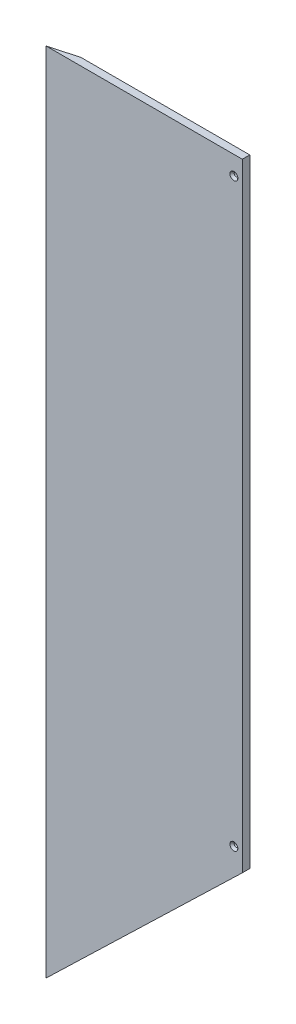
ISO-10303-21;
HEADER;
FILE_DESCRIPTION(('STEP AP214'),'2;1');
FILE_NAME('part.step','',(''),(''),'','','');
FILE_SCHEMA(('AUTOMOTIVE_DESIGN { 1 0 10303 214 1 1 1 1 }'));
ENDSEC;
DATA;
#1=APPLICATION_CONTEXT('core data for automotive mechanical design processes');
#2=APPLICATION_PROTOCOL_DEFINITION('international standard','automotive_design',2000,#1);
#3=PRODUCT_CONTEXT('',#1,'mechanical');
#4=PRODUCT('Part','Part','',(#3));
#5=PRODUCT_RELATED_PRODUCT_CATEGORY('part','',(#4));
#6=PRODUCT_DEFINITION_FORMATION('','',#4);
#7=PRODUCT_DEFINITION_CONTEXT('part definition',#1,'design');
#8=PRODUCT_DEFINITION('design','',#6,#7);
#9=PRODUCT_DEFINITION_SHAPE('','',#8);
#10=(LENGTH_UNIT() NAMED_UNIT(*) SI_UNIT(.MILLI.,.METRE.));
#11=(NAMED_UNIT(*) PLANE_ANGLE_UNIT() SI_UNIT($,.RADIAN.));
#12=(NAMED_UNIT(*) SI_UNIT($,.STERADIAN.) SOLID_ANGLE_UNIT());
#13=UNCERTAINTY_MEASURE_WITH_UNIT(LENGTH_MEASURE(1.E-05),#10,'distance_accuracy_value','');
#14=(GEOMETRIC_REPRESENTATION_CONTEXT(3) GLOBAL_UNCERTAINTY_ASSIGNED_CONTEXT((#13)) GLOBAL_UNIT_ASSIGNED_CONTEXT((#10,
#11,#12)) REPRESENTATION_CONTEXT('',''));
#15=CARTESIAN_POINT('',(0.,0.,0.));
#16=DIRECTION('',(0.,0.,1.));
#17=DIRECTION('',(1.,0.,0.));
#18=AXIS2_PLACEMENT_3D('',#15,#16,#17);
#19=CARTESIAN_POINT('',(-1480.98408110292,1371.6,12.7020000000002));
#20=DIRECTION('',(0.,-1.,0.));
#21=DIRECTION('',(-0.26471698178117,0.,-0.964326147917118));
#22=AXIS2_PLACEMENT_3D('',#19,#20,#21);
#23=PLANE('',#22);
#24=DIRECTION('',(0.964326147917118,0.,-0.26471698178117));
#25=VECTOR('',#24,1.);
#26=CARTESIAN_POINT('',(-61.2393104383737,1371.6,-422.666784086401));
#27=LINE('',#26,#25);
#28=CARTESIAN_POINT('',(-1647.21830961026,1371.6,12.7000000000002));
#29=VERTEX_POINT('',#28);
#30=CARTESIAN_POINT('',(-1600.95402389598,1371.6,2.22044604925031E-13));
#31=VERTEX_POINT('',#30);
#32=EDGE_CURVE('E104',#29,#31,#27,.T.);
#33=ORIENTED_EDGE('',*,*,#32,.F.);
#34=DIRECTION('',(-1.,0.,0.));
#35=VECTOR('',#34,1.);
#36=CARTESIAN_POINT('',(-1480.98408110292,1371.6,12.7000000000001));
#37=LINE('',#36,#35);
#38=CARTESIAN_POINT('',(-1314.74985259558,1371.6,12.7000000000002));
#39=VERTEX_POINT('',#38);
#40=EDGE_CURVE('E109',#39,#29,#37,.T.);
#41=ORIENTED_EDGE('',*,*,#40,.F.);
#42=DIRECTION('',(0.,0.,-1.));
#43=VECTOR('',#42,1.);
#44=CARTESIAN_POINT('',(-1314.74985259558,1371.6,12.7019999999997));
#45=LINE('',#44,#43);
#46=CARTESIAN_POINT('',(-1314.74985259558,1371.6,0.));
#47=VERTEX_POINT('',#46);
#48=EDGE_CURVE('E79',#39,#47,#45,.T.);
#49=ORIENTED_EDGE('',*,*,#48,.T.);
#50=DIRECTION('',(-1.,0.,0.));
#51=VECTOR('',#50,1.);
#52=CARTESIAN_POINT('',(-1480.98408110292,1371.6,-1.11022302462516E-13));
#53=LINE('',#52,#51);
#54=EDGE_CURVE('E111',#47,#31,#53,.T.);
#55=ORIENTED_EDGE('',*,*,#54,.T.);
#56=EDGE_LOOP('',(#33,#41,#49,#55));
#57=FACE_BOUND('',#56,.T.);
#58=ADVANCED_FACE('F48',(#57),#23,.F.);
#59=CARTESIAN_POINT('',(-1480.98408110292,687.420986771541,0.));
#60=DIRECTION('',(0.,0.,1.));
#61=DIRECTION('',(1.,0.,0.));
#62=AXIS2_PLACEMENT_3D('',#59,#60,#61);
#63=PLANE('',#62);
#64=CARTESIAN_POINT('',(-1329.03735259558,355.6,-3.33066907387547E-13));
#65=DIRECTION('',(0.,0.,1.));
#66=DIRECTION('',(1.,0.,0.));
#67=AXIS2_PLACEMENT_3D('',#64,#65,#66);
#68=CIRCLE('',#67,3.3782);
#69=CARTESIAN_POINT('',(-1325.65915259558,355.6,-3.33254435158636E-13));
#70=VERTEX_POINT('',#69);
#71=EDGE_CURVE('E52',#70,#70,#68,.F.);
#72=ORIENTED_EDGE('',*,*,#71,.F.);
#73=EDGE_LOOP('',(#72));
#74=FACE_BOUND('',#73,.T.);
#75=CARTESIAN_POINT('',(-1329.03735259558,1339.85,-3.88578058618805E-13));
#76=DIRECTION('',(0.,0.,1.));
#77=DIRECTION('',(1.,0.,0.));
#78=AXIS2_PLACEMENT_3D('',#75,#76,#77);
#79=CIRCLE('',#78,3.3782);
#80=CARTESIAN_POINT('',(-1325.65915259558,1339.85,-3.88765586389894E-13));
#81=VERTEX_POINT('',#80);
#82=EDGE_CURVE('E113',#81,#81,#79,.F.);
#83=ORIENTED_EDGE('',*,*,#82,.F.);
#84=EDGE_LOOP('',(#83));
#85=FACE_BOUND('',#84,.T.);
#86=DIRECTION('',(0.,-1.,0.));
#87=VECTOR('',#86,1.);
#88=CARTESIAN_POINT('',(-1600.95402389598,687.420986771541,2.22044604925031E-13));
#89=LINE('',#88,#87);
#90=CARTESIAN_POINT('',(-1600.95402389598,47.8558339720756,2.77555756156289E-13));
#91=VERTEX_POINT('',#90);
#92=EDGE_CURVE('E69',#31,#91,#89,.T.);
#93=ORIENTED_EDGE('',*,*,#92,.F.);
#94=ORIENTED_EDGE('',*,*,#54,.F.);
#95=DIRECTION('',(0.,-1.,0.));
#96=VECTOR('',#95,1.);
#97=CARTESIAN_POINT('',(-1314.74985259558,847.725,0.));
#98=LINE('',#97,#96);
#99=CARTESIAN_POINT('',(-1314.74985259558,323.85,0.));
#100=VERTEX_POINT('',#99);
#101=EDGE_CURVE('E58',#47,#100,#98,.T.);
#102=ORIENTED_EDGE('',*,*,#101,.T.);
#103=DIRECTION('',(-0.719829752215674,-0.694150652110275,0.));
#104=VECTOR('',#103,1.);
#105=CARTESIAN_POINT('',(-1480.98408110292,163.545986771541,1.66533453693773E-13));
#106=LINE('',#105,#104);
#107=EDGE_CURVE('E132',#100,#91,#106,.T.);
#108=ORIENTED_EDGE('',*,*,#107,.T.);
#109=EDGE_LOOP('',(#93,#94,#102,#108));
#110=FACE_BOUND('',#109,.T.);
#111=ADVANCED_FACE('F169',(#74,#85,#110),#63,.F.);
#112=CARTESIAN_POINT('',(-1480.98408110292,163.545986771541,12.702));
#113=DIRECTION('',(0.694150652110275,-0.719829752215675,0.));
#114=DIRECTION('',(0.706175147076652,0.680983159335232,-0.193852001158297));
#115=AXIS2_PLACEMENT_3D('',#112,#113,#114);
#116=PLANE('',#115);
#117=DIRECTION('',(-0.719829752215674,-0.694150652110275,0.));
#118=VECTOR('',#117,1.);
#119=CARTESIAN_POINT('',(-1480.98408110292,163.545986771541,12.6999999999998));
#120=LINE('',#119,#118);
#121=CARTESIAN_POINT('',(-1314.74985259558,323.85,12.7000000000002));
#122=VERTEX_POINT('',#121);
#123=CARTESIAN_POINT('',(-1647.21830961026,3.24197354308218,12.7000000000002));
#124=VERTEX_POINT('',#123);
#125=EDGE_CURVE('E125',#122,#124,#120,.T.);
#126=ORIENTED_EDGE('',*,*,#125,.T.);
#127=DIRECTION('',(0.706175147076652,0.680983159335232,-0.193852001158297));
#128=VECTOR('',#127,1.);
#129=CARTESIAN_POINT('',(-1487.23120419546,157.521722624146,-31.218028937396));
#130=LINE('',#129,#128);
#131=EDGE_CURVE('E11',#124,#91,#130,.T.);
#132=ORIENTED_EDGE('',*,*,#131,.T.);
#133=ORIENTED_EDGE('',*,*,#107,.F.);
#134=DIRECTION('',(0.,0.,-1.));
#135=VECTOR('',#134,1.);
#136=CARTESIAN_POINT('',(-1314.74985259558,323.85,12.7019999999998));
#137=LINE('',#136,#135);
#138=EDGE_CURVE('E130',#122,#100,#137,.T.);
#139=ORIENTED_EDGE('',*,*,#138,.F.);
#140=EDGE_LOOP('',(#126,#132,#133,#139));
#141=FACE_BOUND('',#140,.T.);
#142=ADVANCED_FACE('F50',(#141),#116,.T.);
#143=CARTESIAN_POINT('',(-1311.38794692696,660.4,12.7));
#144=DIRECTION('',(0.,0.,1.));
#145=DIRECTION('',(0.,1.,0.));
#146=AXIS2_PLACEMENT_3D('',#143,#144,#145);
#147=PLANE('',#146);
#148=CARTESIAN_POINT('',(-1329.03735259558,355.6,12.7000000000008));
#149=DIRECTION('',(0.,0.,1.));
#150=DIRECTION('',(1.,0.,0.));
#151=AXIS2_PLACEMENT_3D('',#148,#149,#150);
#152=CIRCLE('',#151,6.7437);
#153=CARTESIAN_POINT('',(-1322.29365259558,355.6,12.7000000000008));
#154=VERTEX_POINT('',#153);
#155=EDGE_CURVE('E212',#154,#154,#152,.T.);
#156=ORIENTED_EDGE('',*,*,#155,.F.);
#157=EDGE_LOOP('',(#156));
#158=FACE_BOUND('',#157,.T.);
#159=CARTESIAN_POINT('',(-1329.03735259558,1339.85,12.7000000000008));
#160=DIRECTION('',(0.,0.,1.));
#161=DIRECTION('',(1.,0.,0.));
#162=AXIS2_PLACEMENT_3D('',#159,#160,#161);
#163=CIRCLE('',#162,6.74369999999991);
#164=CARTESIAN_POINT('',(-1322.29365259558,1339.85,12.7000000000008));
#165=VERTEX_POINT('',#164);
#166=EDGE_CURVE('E141',#165,#165,#163,.T.);
#167=ORIENTED_EDGE('',*,*,#166,.F.);
#168=EDGE_LOOP('',(#167));
#169=FACE_BOUND('',#168,.T.);
#170=DIRECTION('',(0.,-1.,0.));
#171=VECTOR('',#170,1.);
#172=CARTESIAN_POINT('',(-1314.74985259558,847.725,12.7));
#173=LINE('',#172,#171);
#174=EDGE_CURVE('E118',#39,#122,#173,.T.);
#175=ORIENTED_EDGE('',*,*,#174,.F.);
#176=ORIENTED_EDGE('',*,*,#40,.T.);
#177=DIRECTION('',(0.,-1.,0.));
#178=VECTOR('',#177,1.);
#179=CARTESIAN_POINT('',(-1647.21830961026,687.420986771541,12.7000000000001));
#180=LINE('',#179,#178);
#181=EDGE_CURVE('E101',#29,#124,#180,.T.);
#182=ORIENTED_EDGE('',*,*,#181,.T.);
#183=ORIENTED_EDGE('',*,*,#125,.F.);
#184=EDGE_LOOP('',(#175,#176,#182,#183));
#185=FACE_BOUND('',#184,.T.);
#186=ADVANCED_FACE('F116',(#158,#169,#185),#147,.T.);
#187=CARTESIAN_POINT('',(-1314.74985259558,847.725,12.7019999999997));
#188=DIRECTION('',(1.,0.,0.));
#189=DIRECTION('',(0.,0.,-1.));
#190=AXIS2_PLACEMENT_3D('',#187,#188,#189);
#191=PLANE('',#190);
#192=ORIENTED_EDGE('',*,*,#48,.F.);
#193=ORIENTED_EDGE('',*,*,#174,.T.);
#194=ORIENTED_EDGE('',*,*,#138,.T.);
#195=ORIENTED_EDGE('',*,*,#101,.F.);
#196=EDGE_LOOP('',(#192,#193,#194,#195));
#197=FACE_BOUND('',#196,.T.);
#198=ADVANCED_FACE('F166',(#197),#191,.T.);
#199=CARTESIAN_POINT('',(-61.2393104383733,685.8,-422.666784086401));
#200=DIRECTION('',(-0.26471698178117,0.,-0.964326147917118));
#201=DIRECTION('',(0.964326147917118,0.,-0.26471698178117));
#202=AXIS2_PLACEMENT_3D('',#199,#200,#201);
#203=PLANE('',#202);
#204=ORIENTED_EDGE('',*,*,#92,.T.);
#205=ORIENTED_EDGE('',*,*,#131,.F.);
#206=ORIENTED_EDGE('',*,*,#181,.F.);
#207=ORIENTED_EDGE('',*,*,#32,.T.);
#208=EDGE_LOOP('',(#204,#205,#206,#207));
#209=FACE_BOUND('',#208,.T.);
#210=ADVANCED_FACE('F103',(#209),#203,.T.);
#211=CARTESIAN_POINT('',(-1329.03735259558,1339.85,-3553.21699062703));
#212=DIRECTION('',(0.,0.,1.));
#213=DIRECTION('',(1.,0.,0.));
#214=AXIS2_PLACEMENT_3D('',#211,#212,#213);
#215=CYLINDRICAL_SURFACE('',#214,3.3782);
#216=CARTESIAN_POINT('',(-1329.03735259558,1339.85,8.82843512549863));
#217=DIRECTION('',(0.,0.,1.));
#218=DIRECTION('',(1.,0.,0.));
#219=AXIS2_PLACEMENT_3D('',#216,#217,#218);
#220=CIRCLE('',#219,3.3782);
#221=CARTESIAN_POINT('',(-1325.65915259558,1339.85,8.82843512549863));
#222=VERTEX_POINT('',#221);
#223=EDGE_CURVE('E135',#222,#222,#220,.T.);
#224=ORIENTED_EDGE('',*,*,#223,.T.);
#225=EDGE_LOOP('',(#224));
#226=FACE_BOUND('',#225,.T.);
#227=ORIENTED_EDGE('',*,*,#82,.T.);
#228=EDGE_LOOP('',(#227));
#229=FACE_BOUND('',#228,.T.);
#230=ADVANCED_FACE('F189',(#226,#229),#215,.F.);
#231=CARTESIAN_POINT('',(-1329.03735259558,1339.85,8.82843512549863));
#232=DIRECTION('',(0.,0.,1.));
#233=DIRECTION('',(1.,0.,0.));
#234=AXIS2_PLACEMENT_3D('',#231,#232,#233);
#235=CONICAL_SURFACE('',#234,3.3782,0.715584993317671);
#236=ORIENTED_EDGE('',*,*,#166,.T.);
#237=EDGE_LOOP('',(#236));
#238=FACE_BOUND('',#237,.T.);
#239=ORIENTED_EDGE('',*,*,#223,.F.);
#240=EDGE_LOOP('',(#239));
#241=FACE_BOUND('',#240,.T.);
#242=ADVANCED_FACE('F193',(#238,#241),#235,.F.);
#243=CARTESIAN_POINT('',(-1329.03735259558,355.6,-3553.21699062703));
#244=DIRECTION('',(0.,0.,1.));
#245=DIRECTION('',(1.,0.,0.));
#246=AXIS2_PLACEMENT_3D('',#243,#244,#245);
#247=CYLINDRICAL_SURFACE('',#246,3.3782);
#248=CARTESIAN_POINT('',(-1329.03735259558,355.6,8.82843512549697));
#249=DIRECTION('',(0.,0.,1.));
#250=DIRECTION('',(1.,0.,0.));
#251=AXIS2_PLACEMENT_3D('',#248,#249,#250);
#252=CIRCLE('',#251,3.3782);
#253=CARTESIAN_POINT('',(-1325.65915259558,355.6,8.82843512549697));
#254=VERTEX_POINT('',#253);
#255=EDGE_CURVE('E215',#254,#254,#252,.T.);
#256=ORIENTED_EDGE('',*,*,#255,.T.);
#257=EDGE_LOOP('',(#256));
#258=FACE_BOUND('',#257,.T.);
#259=ORIENTED_EDGE('',*,*,#71,.T.);
#260=EDGE_LOOP('',(#259));
#261=FACE_BOUND('',#260,.T.);
#262=ADVANCED_FACE('F197',(#258,#261),#247,.F.);
#263=CARTESIAN_POINT('',(-1329.03735259558,355.6,8.82843512549697));
#264=DIRECTION('',(0.,0.,1.));
#265=DIRECTION('',(1.,0.,0.));
#266=AXIS2_PLACEMENT_3D('',#263,#264,#265);
#267=CONICAL_SURFACE('',#266,3.3782,0.715584993317453);
#268=ORIENTED_EDGE('',*,*,#155,.T.);
#269=EDGE_LOOP('',(#268));
#270=FACE_BOUND('',#269,.T.);
#271=ORIENTED_EDGE('',*,*,#255,.F.);
#272=EDGE_LOOP('',(#271));
#273=FACE_BOUND('',#272,.T.);
#274=ADVANCED_FACE('F203',(#270,#273),#267,.F.);
#275=CLOSED_SHELL('',(#58,#111,#142,#186,#198,#210,#230,#242,#262,#274));
#276=MANIFOLD_SOLID_BREP('B2',#275);
#277=ADVANCED_BREP_SHAPE_REPRESENTATION('',(#18,#276),#14);
#278=SHAPE_DEFINITION_REPRESENTATION(#9,#277);
ENDSEC;
END-ISO-10303-21;
